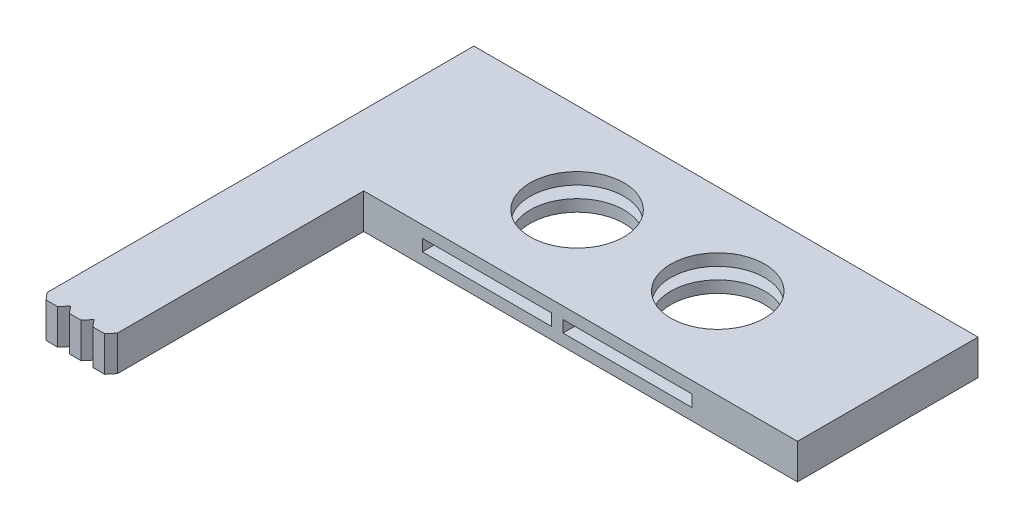
ISO-10303-21;
HEADER;
FILE_DESCRIPTION(('STEP AP214'),'2;1');
FILE_NAME('part.step','',(''),(''),'','','');
FILE_SCHEMA(('AUTOMOTIVE_DESIGN { 1 0 10303 214 1 1 1 1 }'));
ENDSEC;
DATA;
#1=APPLICATION_CONTEXT('core data for automotive mechanical design processes');
#2=APPLICATION_PROTOCOL_DEFINITION('international standard','automotive_design',2000,#1);
#3=PRODUCT_CONTEXT('',#1,'mechanical');
#4=PRODUCT('Part','Part','',(#3));
#5=PRODUCT_RELATED_PRODUCT_CATEGORY('part','',(#4));
#6=PRODUCT_DEFINITION_FORMATION('','',#4);
#7=PRODUCT_DEFINITION_CONTEXT('part definition',#1,'design');
#8=PRODUCT_DEFINITION('design','',#6,#7);
#9=PRODUCT_DEFINITION_SHAPE('','',#8);
#10=(LENGTH_UNIT() NAMED_UNIT(*) SI_UNIT(.MILLI.,.METRE.));
#11=(NAMED_UNIT(*) PLANE_ANGLE_UNIT() SI_UNIT($,.RADIAN.));
#12=(NAMED_UNIT(*) SI_UNIT($,.STERADIAN.) SOLID_ANGLE_UNIT());
#13=UNCERTAINTY_MEASURE_WITH_UNIT(LENGTH_MEASURE(1.E-05),#10,'distance_accuracy_value','');
#14=(GEOMETRIC_REPRESENTATION_CONTEXT(3) GLOBAL_UNCERTAINTY_ASSIGNED_CONTEXT((#13)) GLOBAL_UNIT_ASSIGNED_CONTEXT((#10,
#11,#12)) REPRESENTATION_CONTEXT('',''));
#15=CARTESIAN_POINT('',(0.,0.,0.));
#16=DIRECTION('',(0.,0.,1.));
#17=DIRECTION('',(1.,0.,0.));
#18=AXIS2_PLACEMENT_3D('',#15,#16,#17);
#19=CARTESIAN_POINT('',(16.5,3.,0.));
#20=DIRECTION('',(0.,-1.,0.));
#21=DIRECTION('',(0.,0.,-1.));
#22=AXIS2_PLACEMENT_3D('',#19,#20,#21);
#23=CYLINDRICAL_SURFACE('',#22,4.);
#24=CARTESIAN_POINT('',(16.5,2.,0.));
#25=DIRECTION('',(0.,1.,0.));
#26=DIRECTION('',(-1.,0.,0.));
#27=AXIS2_PLACEMENT_3D('',#24,#25,#26);
#28=CIRCLE('',#27,4.);
#29=CARTESIAN_POINT('',(12.5,2.,0.));
#30=VERTEX_POINT('',#29);
#31=EDGE_CURVE('E39',#30,#30,#28,.T.);
#32=ORIENTED_EDGE('',*,*,#31,.F.);
#33=EDGE_LOOP('',(#32));
#34=FACE_BOUND('',#33,.T.);
#35=CARTESIAN_POINT('',(16.5,3.,0.));
#36=DIRECTION('',(0.,1.,0.));
#37=DIRECTION('',(0.,0.,1.));
#38=AXIS2_PLACEMENT_3D('',#35,#36,#37);
#39=CIRCLE('',#38,4.);
#40=CARTESIAN_POINT('',(16.5,3.,4.));
#41=VERTEX_POINT('',#40);
#42=EDGE_CURVE('E256',#41,#41,#39,.T.);
#43=ORIENTED_EDGE('',*,*,#42,.T.);
#44=EDGE_LOOP('',(#43));
#45=FACE_BOUND('',#44,.T.);
#46=ADVANCED_FACE('F35',(#34,#45),#23,.F.);
#47=CARTESIAN_POINT('',(28.5,3.,0.));
#48=DIRECTION('',(0.,-1.,0.));
#49=DIRECTION('',(0.,0.,-1.));
#50=AXIS2_PLACEMENT_3D('',#47,#48,#49);
#51=CYLINDRICAL_SURFACE('',#50,4.);
#52=CARTESIAN_POINT('',(28.5,2.,0.));
#53=DIRECTION('',(0.,1.,0.));
#54=DIRECTION('',(-1.,0.,0.));
#55=AXIS2_PLACEMENT_3D('',#52,#53,#54);
#56=CIRCLE('',#55,4.);
#57=CARTESIAN_POINT('',(24.5,2.,0.));
#58=VERTEX_POINT('',#57);
#59=EDGE_CURVE('E359',#58,#58,#56,.T.);
#60=ORIENTED_EDGE('',*,*,#59,.F.);
#61=EDGE_LOOP('',(#60));
#62=FACE_BOUND('',#61,.T.);
#63=CARTESIAN_POINT('',(28.5,3.,0.));
#64=DIRECTION('',(0.,1.,0.));
#65=DIRECTION('',(0.,0.,1.));
#66=AXIS2_PLACEMENT_3D('',#63,#64,#65);
#67=CIRCLE('',#66,4.);
#68=CARTESIAN_POINT('',(28.5,3.,4.));
#69=VERTEX_POINT('',#68);
#70=EDGE_CURVE('E249',#69,#69,#67,.T.);
#71=ORIENTED_EDGE('',*,*,#70,.T.);
#72=EDGE_LOOP('',(#71));
#73=FACE_BOUND('',#72,.T.);
#74=ADVANCED_FACE('F373',(#62,#73),#51,.F.);
#75=CARTESIAN_POINT('',(0.,3.,0.));
#76=DIRECTION('',(0.,1.,0.));
#77=DIRECTION('',(0.,0.,1.));
#78=AXIS2_PLACEMENT_3D('',#75,#76,#77);
#79=PLANE('',#78);
#80=ORIENTED_EDGE('',*,*,#42,.F.);
#81=EDGE_LOOP('',(#80));
#82=FACE_BOUND('',#81,.T.);
#83=DIRECTION('',(-1.,0.,0.));
#84=VECTOR('',#83,1.);
#85=CARTESIAN_POINT('',(43.,3.,-7.7));
#86=LINE('',#85,#84);
#87=CARTESIAN_POINT('',(43.,3.,-7.7));
#88=VERTEX_POINT('',#87);
#89=CARTESIAN_POINT('',(0.,3.,-7.69999999999999));
#90=VERTEX_POINT('',#89);
#91=EDGE_CURVE('E262',#88,#90,#86,.T.);
#92=ORIENTED_EDGE('',*,*,#91,.T.);
#93=DIRECTION('',(0.,0.,1.));
#94=VECTOR('',#93,1.);
#95=CARTESIAN_POINT('',(0.,3.,-7.69999999999999));
#96=LINE('',#95,#94);
#97=CARTESIAN_POINT('',(0.,3.,28.7));
#98=VERTEX_POINT('',#97);
#99=EDGE_CURVE('E265',#90,#98,#96,.T.);
#100=ORIENTED_EDGE('',*,*,#99,.T.);
#101=DIRECTION('',(0.640868523132762,0.,0.767650660168825));
#102=VECTOR('',#101,1.);
#103=CARTESIAN_POINT('',(0.,3.,28.7));
#104=LINE('',#103,#102);
#105=CARTESIAN_POINT('',(0.50090638076843,3.,29.3));
#106=VERTEX_POINT('',#105);
#107=EDGE_CURVE('E268',#98,#106,#104,.T.);
#108=ORIENTED_EDGE('',*,*,#107,.T.);
#109=DIRECTION('',(1.,0.,0.));
#110=VECTOR('',#109,1.);
#111=CARTESIAN_POINT('',(0.50090638076843,3.,29.3));
#112=LINE('',#111,#110);
#113=CARTESIAN_POINT('',(1.49909361923161,3.,29.3));
#114=VERTEX_POINT('',#113);
#115=EDGE_CURVE('E270',#106,#114,#112,.T.);
#116=ORIENTED_EDGE('',*,*,#115,.T.);
#117=DIRECTION('',(0.640868523132743,0.,-0.76765066016884));
#118=VECTOR('',#117,1.);
#119=CARTESIAN_POINT('',(2.00000000000001,3.,28.7));
#120=LINE('',#119,#118);
#121=CARTESIAN_POINT('',(2.00000000000001,3.,28.7));
#122=VERTEX_POINT('',#121);
#123=EDGE_CURVE('E272',#114,#122,#120,.T.);
#124=ORIENTED_EDGE('',*,*,#123,.T.);
#125=DIRECTION('',(0.640868523132738,0.,0.767650660168845));
#126=VECTOR('',#125,1.);
#127=CARTESIAN_POINT('',(2.00000000000001,3.,28.7));
#128=LINE('',#127,#126);
#129=CARTESIAN_POINT('',(2.50090638076841,3.,29.3));
#130=VERTEX_POINT('',#129);
#131=EDGE_CURVE('E274',#122,#130,#128,.T.);
#132=ORIENTED_EDGE('',*,*,#131,.T.);
#133=DIRECTION('',(1.,0.,0.));
#134=VECTOR('',#133,1.);
#135=CARTESIAN_POINT('',(2.50090638076841,3.,29.3));
#136=LINE('',#135,#134);
#137=CARTESIAN_POINT('',(3.49909361923159,3.,29.3));
#138=VERTEX_POINT('',#137);
#139=EDGE_CURVE('E276',#130,#138,#136,.T.);
#140=ORIENTED_EDGE('',*,*,#139,.T.);
#141=DIRECTION('',(0.640868523132749,0.,-0.767650660168835));
#142=VECTOR('',#141,1.);
#143=CARTESIAN_POINT('',(4.,3.,28.7));
#144=LINE('',#143,#142);
#145=CARTESIAN_POINT('',(4.,3.,28.7));
#146=VERTEX_POINT('',#145);
#147=EDGE_CURVE('E278',#138,#146,#144,.T.);
#148=ORIENTED_EDGE('',*,*,#147,.T.);
#149=DIRECTION('',(0.640868523132732,0.,0.76765066016885));
#150=VECTOR('',#149,1.);
#151=CARTESIAN_POINT('',(4.,3.,28.7));
#152=LINE('',#151,#150);
#153=CARTESIAN_POINT('',(4.50090638076838,3.,29.3));
#154=VERTEX_POINT('',#153);
#155=EDGE_CURVE('E280',#146,#154,#152,.T.);
#156=ORIENTED_EDGE('',*,*,#155,.T.);
#157=DIRECTION('',(1.,0.,0.));
#158=VECTOR('',#157,1.);
#159=CARTESIAN_POINT('',(4.50090638076838,3.,29.3));
#160=LINE('',#159,#158);
#161=CARTESIAN_POINT('',(5.49909361923156,3.,29.3));
#162=VERTEX_POINT('',#161);
#163=EDGE_CURVE('E282',#154,#162,#160,.T.);
#164=ORIENTED_EDGE('',*,*,#163,.T.);
#165=DIRECTION('',(0.640868523132743,0.,-0.76765066016884));
#166=VECTOR('',#165,1.);
#167=CARTESIAN_POINT('',(5.99999999999997,3.,28.7));
#168=LINE('',#167,#166);
#169=CARTESIAN_POINT('',(5.99999999999997,3.,28.7));
#170=VERTEX_POINT('',#169);
#171=EDGE_CURVE('E284',#162,#170,#168,.T.);
#172=ORIENTED_EDGE('',*,*,#171,.T.);
#173=DIRECTION('',(0.,0.,-1.));
#174=VECTOR('',#173,1.);
#175=CARTESIAN_POINT('',(5.99999999999997,3.,28.7));
#176=LINE('',#175,#174);
#177=CARTESIAN_POINT('',(5.99999999999998,3.,7.7));
#178=VERTEX_POINT('',#177);
#179=EDGE_CURVE('E286',#170,#178,#176,.T.);
#180=ORIENTED_EDGE('',*,*,#179,.T.);
#181=DIRECTION('',(1.,0.,0.));
#182=VECTOR('',#181,1.);
#183=CARTESIAN_POINT('',(5.99999999999998,3.,7.7));
#184=LINE('',#183,#182);
#185=CARTESIAN_POINT('',(43.,3.,7.7));
#186=VERTEX_POINT('',#185);
#187=EDGE_CURVE('E288',#178,#186,#184,.T.);
#188=ORIENTED_EDGE('',*,*,#187,.T.);
#189=DIRECTION('',(0.,0.,-1.));
#190=VECTOR('',#189,1.);
#191=CARTESIAN_POINT('',(43.,3.,-7.7));
#192=LINE('',#191,#190);
#193=EDGE_CURVE('E290',#186,#88,#192,.T.);
#194=ORIENTED_EDGE('',*,*,#193,.T.);
#195=EDGE_LOOP('',(#92,#100,#108,#116,#124,#132,#140,#148,#156,#164,#172,#180,#188,#194));
#196=FACE_BOUND('',#195,.T.);
#197=ORIENTED_EDGE('',*,*,#70,.F.);
#198=EDGE_LOOP('',(#197));
#199=FACE_BOUND('',#198,.T.);
#200=ADVANCED_FACE('F378',(#82,#196,#199),#79,.T.);
#201=CARTESIAN_POINT('',(0.,0.,0.));
#202=DIRECTION('',(0.,1.,0.));
#203=DIRECTION('',(0.,0.,1.));
#204=AXIS2_PLACEMENT_3D('',#201,#202,#203);
#205=PLANE('',#204);
#206=DIRECTION('',(-1.,0.,0.));
#207=VECTOR('',#206,1.);
#208=CARTESIAN_POINT('',(43.,0.,-7.7));
#209=LINE('',#208,#207);
#210=CARTESIAN_POINT('',(43.,0.,-7.7));
#211=VERTEX_POINT('',#210);
#212=CARTESIAN_POINT('',(0.,0.,-7.69999999999999));
#213=VERTEX_POINT('',#212);
#214=EDGE_CURVE('E259',#211,#213,#209,.T.);
#215=ORIENTED_EDGE('',*,*,#214,.F.);
#216=DIRECTION('',(0.,0.,-1.));
#217=VECTOR('',#216,1.);
#218=CARTESIAN_POINT('',(43.,0.,-7.7));
#219=LINE('',#218,#217);
#220=CARTESIAN_POINT('',(43.,0.,7.7));
#221=VERTEX_POINT('',#220);
#222=EDGE_CURVE('E266',#221,#211,#219,.T.);
#223=ORIENTED_EDGE('',*,*,#222,.F.);
#224=DIRECTION('',(1.,0.,0.));
#225=VECTOR('',#224,1.);
#226=CARTESIAN_POINT('',(5.99999999999998,0.,7.7));
#227=LINE('',#226,#225);
#228=CARTESIAN_POINT('',(5.99999999999998,0.,7.7));
#229=VERTEX_POINT('',#228);
#230=EDGE_CURVE('E317',#229,#221,#227,.T.);
#231=ORIENTED_EDGE('',*,*,#230,.F.);
#232=DIRECTION('',(0.,0.,-1.));
#233=VECTOR('',#232,1.);
#234=CARTESIAN_POINT('',(5.99999999999997,0.,28.7));
#235=LINE('',#234,#233);
#236=CARTESIAN_POINT('',(5.99999999999997,0.,28.7));
#237=VERTEX_POINT('',#236);
#238=EDGE_CURVE('E315',#237,#229,#235,.T.);
#239=ORIENTED_EDGE('',*,*,#238,.F.);
#240=DIRECTION('',(0.640868523132743,0.,-0.76765066016884));
#241=VECTOR('',#240,1.);
#242=CARTESIAN_POINT('',(5.99999999999997,0.,28.7));
#243=LINE('',#242,#241);
#244=CARTESIAN_POINT('',(5.49909361923156,0.,29.3));
#245=VERTEX_POINT('',#244);
#246=EDGE_CURVE('E313',#245,#237,#243,.T.);
#247=ORIENTED_EDGE('',*,*,#246,.F.);
#248=DIRECTION('',(1.,0.,0.));
#249=VECTOR('',#248,1.);
#250=CARTESIAN_POINT('',(4.50090638076838,0.,29.3));
#251=LINE('',#250,#249);
#252=CARTESIAN_POINT('',(4.50090638076838,0.,29.3));
#253=VERTEX_POINT('',#252);
#254=EDGE_CURVE('E311',#253,#245,#251,.T.);
#255=ORIENTED_EDGE('',*,*,#254,.F.);
#256=DIRECTION('',(0.640868523132732,0.,0.76765066016885));
#257=VECTOR('',#256,1.);
#258=CARTESIAN_POINT('',(4.,0.,28.7));
#259=LINE('',#258,#257);
#260=CARTESIAN_POINT('',(4.,0.,28.7));
#261=VERTEX_POINT('',#260);
#262=EDGE_CURVE('E309',#261,#253,#259,.T.);
#263=ORIENTED_EDGE('',*,*,#262,.F.);
#264=DIRECTION('',(0.640868523132749,0.,-0.767650660168835));
#265=VECTOR('',#264,1.);
#266=CARTESIAN_POINT('',(4.,0.,28.7));
#267=LINE('',#266,#265);
#268=CARTESIAN_POINT('',(3.49909361923159,0.,29.3));
#269=VERTEX_POINT('',#268);
#270=EDGE_CURVE('E307',#269,#261,#267,.T.);
#271=ORIENTED_EDGE('',*,*,#270,.F.);
#272=DIRECTION('',(1.,0.,0.));
#273=VECTOR('',#272,1.);
#274=CARTESIAN_POINT('',(2.50090638076841,0.,29.3));
#275=LINE('',#274,#273);
#276=CARTESIAN_POINT('',(2.50090638076841,0.,29.3));
#277=VERTEX_POINT('',#276);
#278=EDGE_CURVE('E305',#277,#269,#275,.T.);
#279=ORIENTED_EDGE('',*,*,#278,.F.);
#280=DIRECTION('',(0.640868523132738,0.,0.767650660168845));
#281=VECTOR('',#280,1.);
#282=CARTESIAN_POINT('',(2.00000000000001,0.,28.7));
#283=LINE('',#282,#281);
#284=CARTESIAN_POINT('',(2.00000000000001,0.,28.7));
#285=VERTEX_POINT('',#284);
#286=EDGE_CURVE('E303',#285,#277,#283,.T.);
#287=ORIENTED_EDGE('',*,*,#286,.F.);
#288=DIRECTION('',(0.640868523132743,0.,-0.76765066016884));
#289=VECTOR('',#288,1.);
#290=CARTESIAN_POINT('',(2.00000000000001,0.,28.7));
#291=LINE('',#290,#289);
#292=CARTESIAN_POINT('',(1.49909361923161,0.,29.3));
#293=VERTEX_POINT('',#292);
#294=EDGE_CURVE('E301',#293,#285,#291,.T.);
#295=ORIENTED_EDGE('',*,*,#294,.F.);
#296=DIRECTION('',(1.,0.,0.));
#297=VECTOR('',#296,1.);
#298=CARTESIAN_POINT('',(0.50090638076843,0.,29.3));
#299=LINE('',#298,#297);
#300=CARTESIAN_POINT('',(0.50090638076843,0.,29.3));
#301=VERTEX_POINT('',#300);
#302=EDGE_CURVE('E299',#301,#293,#299,.T.);
#303=ORIENTED_EDGE('',*,*,#302,.F.);
#304=DIRECTION('',(0.640868523132762,0.,0.767650660168825));
#305=VECTOR('',#304,1.);
#306=CARTESIAN_POINT('',(0.,0.,28.7));
#307=LINE('',#306,#305);
#308=CARTESIAN_POINT('',(0.,0.,28.7));
#309=VERTEX_POINT('',#308);
#310=EDGE_CURVE('E297',#309,#301,#307,.T.);
#311=ORIENTED_EDGE('',*,*,#310,.F.);
#312=DIRECTION('',(0.,0.,1.));
#313=VECTOR('',#312,1.);
#314=CARTESIAN_POINT('',(0.,0.,-7.69999999999999));
#315=LINE('',#314,#313);
#316=EDGE_CURVE('E295',#213,#309,#315,.T.);
#317=ORIENTED_EDGE('',*,*,#316,.F.);
#318=EDGE_LOOP('',(#215,#223,#231,#239,#247,#255,#263,#271,#279,#287,#295,#303,#311,#317));
#319=FACE_BOUND('',#318,.T.);
#320=CARTESIAN_POINT('',(16.5,0.,0.));
#321=DIRECTION('',(0.,1.,0.));
#322=DIRECTION('',(0.,0.,1.));
#323=AXIS2_PLACEMENT_3D('',#320,#321,#322);
#324=CIRCLE('',#323,4.);
#325=CARTESIAN_POINT('',(16.5,0.,4.));
#326=VERTEX_POINT('',#325);
#327=EDGE_CURVE('E252',#326,#326,#324,.T.);
#328=ORIENTED_EDGE('',*,*,#327,.T.);
#329=EDGE_LOOP('',(#328));
#330=FACE_BOUND('',#329,.T.);
#331=CARTESIAN_POINT('',(28.5,0.,0.));
#332=DIRECTION('',(0.,1.,0.));
#333=DIRECTION('',(0.,0.,1.));
#334=AXIS2_PLACEMENT_3D('',#331,#332,#333);
#335=CIRCLE('',#334,4.);
#336=CARTESIAN_POINT('',(28.5,0.,4.));
#337=VERTEX_POINT('',#336);
#338=EDGE_CURVE('E253',#337,#337,#335,.T.);
#339=ORIENTED_EDGE('',*,*,#338,.T.);
#340=EDGE_LOOP('',(#339));
#341=FACE_BOUND('',#340,.T.);
#342=ADVANCED_FACE('F381',(#319,#330,#341),#205,.F.);
#343=CARTESIAN_POINT('',(43.,3.,-7.7));
#344=DIRECTION('',(0.,0.,1.));
#345=DIRECTION('',(1.,0.,0.));
#346=AXIS2_PLACEMENT_3D('',#343,#344,#345);
#347=PLANE('',#346);
#348=ORIENTED_EDGE('',*,*,#214,.T.);
#349=DIRECTION('',(0.,-1.,0.));
#350=VECTOR('',#349,1.);
#351=CARTESIAN_POINT('',(0.,3.,-7.69999999999999));
#352=LINE('',#351,#350);
#353=EDGE_CURVE('E12',#90,#213,#352,.T.);
#354=ORIENTED_EDGE('',*,*,#353,.F.);
#355=ORIENTED_EDGE('',*,*,#91,.F.);
#356=DIRECTION('',(0.,-1.,0.));
#357=VECTOR('',#356,1.);
#358=CARTESIAN_POINT('',(43.,3.,-7.7));
#359=LINE('',#358,#357);
#360=EDGE_CURVE('E292',#88,#211,#359,.T.);
#361=ORIENTED_EDGE('',*,*,#360,.T.);
#362=EDGE_LOOP('',(#348,#354,#355,#361));
#363=FACE_BOUND('',#362,.T.);
#364=ADVANCED_FACE('F37',(#363),#347,.F.);
#365=CARTESIAN_POINT('',(0.,3.,-7.69999999999999));
#366=DIRECTION('',(1.,0.,0.));
#367=DIRECTION('',(0.,0.,-1.));
#368=AXIS2_PLACEMENT_3D('',#365,#366,#367);
#369=PLANE('',#368);
#370=ORIENTED_EDGE('',*,*,#316,.T.);
#371=DIRECTION('',(0.,-1.,0.));
#372=VECTOR('',#371,1.);
#373=CARTESIAN_POINT('',(0.,3.,28.7));
#374=LINE('',#373,#372);
#375=EDGE_CURVE('E44',#98,#309,#374,.T.);
#376=ORIENTED_EDGE('',*,*,#375,.F.);
#377=ORIENTED_EDGE('',*,*,#99,.F.);
#378=ORIENTED_EDGE('',*,*,#353,.T.);
#379=EDGE_LOOP('',(#370,#376,#377,#378));
#380=FACE_BOUND('',#379,.T.);
#381=ADVANCED_FACE('F416',(#380),#369,.F.);
#382=CARTESIAN_POINT('',(0.,3.,28.7));
#383=DIRECTION('',(0.767650660168825,0.,-0.640868523132762));
#384=DIRECTION('',(-0.640868523132762,0.,-0.767650660168825));
#385=AXIS2_PLACEMENT_3D('',#382,#383,#384);
#386=PLANE('',#385);
#387=ORIENTED_EDGE('',*,*,#310,.T.);
#388=DIRECTION('',(0.,-1.,0.));
#389=VECTOR('',#388,1.);
#390=CARTESIAN_POINT('',(0.50090638076843,3.,29.3));
#391=LINE('',#390,#389);
#392=EDGE_CURVE('E352',#106,#301,#391,.T.);
#393=ORIENTED_EDGE('',*,*,#392,.F.);
#394=ORIENTED_EDGE('',*,*,#107,.F.);
#395=ORIENTED_EDGE('',*,*,#375,.T.);
#396=EDGE_LOOP('',(#387,#393,#394,#395));
#397=FACE_BOUND('',#396,.T.);
#398=ADVANCED_FACE('F461',(#397),#386,.F.);
#399=CARTESIAN_POINT('',(0.50090638076843,3.,29.3));
#400=DIRECTION('',(0.,0.,-1.));
#401=DIRECTION('',(-1.,0.,0.));
#402=AXIS2_PLACEMENT_3D('',#399,#400,#401);
#403=PLANE('',#402);
#404=ORIENTED_EDGE('',*,*,#302,.T.);
#405=DIRECTION('',(0.,-1.,0.));
#406=VECTOR('',#405,1.);
#407=CARTESIAN_POINT('',(1.49909361923161,3.,29.3));
#408=LINE('',#407,#406);
#409=EDGE_CURVE('E349',#114,#293,#408,.T.);
#410=ORIENTED_EDGE('',*,*,#409,.F.);
#411=ORIENTED_EDGE('',*,*,#115,.F.);
#412=ORIENTED_EDGE('',*,*,#392,.T.);
#413=EDGE_LOOP('',(#404,#410,#411,#412));
#414=FACE_BOUND('',#413,.T.);
#415=ADVANCED_FACE('F457',(#414),#403,.F.);
#416=CARTESIAN_POINT('',(2.00000000000001,3.,28.7));
#417=DIRECTION('',(-0.76765066016884,0.,-0.640868523132743));
#418=DIRECTION('',(-0.640868523132743,0.,0.76765066016884));
#419=AXIS2_PLACEMENT_3D('',#416,#417,#418);
#420=PLANE('',#419);
#421=ORIENTED_EDGE('',*,*,#294,.T.);
#422=DIRECTION('',(0.,-1.,0.));
#423=VECTOR('',#422,1.);
#424=CARTESIAN_POINT('',(2.00000000000001,3.,28.7));
#425=LINE('',#424,#423);
#426=EDGE_CURVE('E346',#122,#285,#425,.T.);
#427=ORIENTED_EDGE('',*,*,#426,.F.);
#428=ORIENTED_EDGE('',*,*,#123,.F.);
#429=ORIENTED_EDGE('',*,*,#409,.T.);
#430=EDGE_LOOP('',(#421,#427,#428,#429));
#431=FACE_BOUND('',#430,.T.);
#432=ADVANCED_FACE('F453',(#431),#420,.F.);
#433=CARTESIAN_POINT('',(2.00000000000001,3.,28.7));
#434=DIRECTION('',(0.767650660168845,0.,-0.640868523132738));
#435=DIRECTION('',(-0.640868523132738,0.,-0.767650660168845));
#436=AXIS2_PLACEMENT_3D('',#433,#434,#435);
#437=PLANE('',#436);
#438=ORIENTED_EDGE('',*,*,#286,.T.);
#439=DIRECTION('',(0.,-1.,0.));
#440=VECTOR('',#439,1.);
#441=CARTESIAN_POINT('',(2.50090638076841,3.,29.3));
#442=LINE('',#441,#440);
#443=EDGE_CURVE('E343',#130,#277,#442,.T.);
#444=ORIENTED_EDGE('',*,*,#443,.F.);
#445=ORIENTED_EDGE('',*,*,#131,.F.);
#446=ORIENTED_EDGE('',*,*,#426,.T.);
#447=EDGE_LOOP('',(#438,#444,#445,#446));
#448=FACE_BOUND('',#447,.T.);
#449=ADVANCED_FACE('F449',(#448),#437,.F.);
#450=CARTESIAN_POINT('',(2.50090638076841,3.,29.3));
#451=DIRECTION('',(0.,0.,-1.));
#452=DIRECTION('',(-1.,0.,0.));
#453=AXIS2_PLACEMENT_3D('',#450,#451,#452);
#454=PLANE('',#453);
#455=ORIENTED_EDGE('',*,*,#278,.T.);
#456=DIRECTION('',(0.,-1.,0.));
#457=VECTOR('',#456,1.);
#458=CARTESIAN_POINT('',(3.49909361923159,3.,29.3));
#459=LINE('',#458,#457);
#460=EDGE_CURVE('E340',#138,#269,#459,.T.);
#461=ORIENTED_EDGE('',*,*,#460,.F.);
#462=ORIENTED_EDGE('',*,*,#139,.F.);
#463=ORIENTED_EDGE('',*,*,#443,.T.);
#464=EDGE_LOOP('',(#455,#461,#462,#463));
#465=FACE_BOUND('',#464,.T.);
#466=ADVANCED_FACE('F445',(#465),#454,.F.);
#467=CARTESIAN_POINT('',(4.,3.,28.7));
#468=DIRECTION('',(-0.767650660168835,0.,-0.640868523132749));
#469=DIRECTION('',(-0.640868523132749,0.,0.767650660168836));
#470=AXIS2_PLACEMENT_3D('',#467,#468,#469);
#471=PLANE('',#470);
#472=ORIENTED_EDGE('',*,*,#270,.T.);
#473=DIRECTION('',(0.,-1.,0.));
#474=VECTOR('',#473,1.);
#475=CARTESIAN_POINT('',(4.,3.,28.7));
#476=LINE('',#475,#474);
#477=EDGE_CURVE('E337',#146,#261,#476,.T.);
#478=ORIENTED_EDGE('',*,*,#477,.F.);
#479=ORIENTED_EDGE('',*,*,#147,.F.);
#480=ORIENTED_EDGE('',*,*,#460,.T.);
#481=EDGE_LOOP('',(#472,#478,#479,#480));
#482=FACE_BOUND('',#481,.T.);
#483=ADVANCED_FACE('F441',(#482),#471,.F.);
#484=CARTESIAN_POINT('',(4.,3.,28.7));
#485=DIRECTION('',(0.767650660168849,0.,-0.640868523132732));
#486=DIRECTION('',(-0.640868523132732,0.,-0.76765066016885));
#487=AXIS2_PLACEMENT_3D('',#484,#485,#486);
#488=PLANE('',#487);
#489=ORIENTED_EDGE('',*,*,#262,.T.);
#490=DIRECTION('',(0.,-1.,0.));
#491=VECTOR('',#490,1.);
#492=CARTESIAN_POINT('',(4.50090638076838,3.,29.3));
#493=LINE('',#492,#491);
#494=EDGE_CURVE('E334',#154,#253,#493,.T.);
#495=ORIENTED_EDGE('',*,*,#494,.F.);
#496=ORIENTED_EDGE('',*,*,#155,.F.);
#497=ORIENTED_EDGE('',*,*,#477,.T.);
#498=EDGE_LOOP('',(#489,#495,#496,#497));
#499=FACE_BOUND('',#498,.T.);
#500=ADVANCED_FACE('F437',(#499),#488,.F.);
#501=CARTESIAN_POINT('',(4.50090638076838,3.,29.3));
#502=DIRECTION('',(0.,0.,-1.));
#503=DIRECTION('',(-1.,0.,0.));
#504=AXIS2_PLACEMENT_3D('',#501,#502,#503);
#505=PLANE('',#504);
#506=ORIENTED_EDGE('',*,*,#254,.T.);
#507=DIRECTION('',(0.,-1.,0.));
#508=VECTOR('',#507,1.);
#509=CARTESIAN_POINT('',(5.49909361923156,3.,29.3));
#510=LINE('',#509,#508);
#511=EDGE_CURVE('E331',#162,#245,#510,.T.);
#512=ORIENTED_EDGE('',*,*,#511,.F.);
#513=ORIENTED_EDGE('',*,*,#163,.F.);
#514=ORIENTED_EDGE('',*,*,#494,.T.);
#515=EDGE_LOOP('',(#506,#512,#513,#514));
#516=FACE_BOUND('',#515,.T.);
#517=ADVANCED_FACE('F433',(#516),#505,.F.);
#518=CARTESIAN_POINT('',(5.99999999999997,3.,28.7));
#519=DIRECTION('',(-0.76765066016884,0.,-0.640868523132743));
#520=DIRECTION('',(-0.640868523132743,0.,0.76765066016884));
#521=AXIS2_PLACEMENT_3D('',#518,#519,#520);
#522=PLANE('',#521);
#523=ORIENTED_EDGE('',*,*,#246,.T.);
#524=DIRECTION('',(0.,-1.,0.));
#525=VECTOR('',#524,1.);
#526=CARTESIAN_POINT('',(5.99999999999997,3.,28.7));
#527=LINE('',#526,#525);
#528=EDGE_CURVE('E328',#170,#237,#527,.T.);
#529=ORIENTED_EDGE('',*,*,#528,.F.);
#530=ORIENTED_EDGE('',*,*,#171,.F.);
#531=ORIENTED_EDGE('',*,*,#511,.T.);
#532=EDGE_LOOP('',(#523,#529,#530,#531));
#533=FACE_BOUND('',#532,.T.);
#534=ADVANCED_FACE('F429',(#533),#522,.F.);
#535=CARTESIAN_POINT('',(5.99999999999997,3.,28.7));
#536=DIRECTION('',(-1.,0.,0.));
#537=DIRECTION('',(0.,0.,1.));
#538=AXIS2_PLACEMENT_3D('',#535,#536,#537);
#539=PLANE('',#538);
#540=ORIENTED_EDGE('',*,*,#238,.T.);
#541=DIRECTION('',(0.,-1.,0.));
#542=VECTOR('',#541,1.);
#543=CARTESIAN_POINT('',(5.99999999999998,3.,7.7));
#544=LINE('',#543,#542);
#545=EDGE_CURVE('E325',#178,#229,#544,.T.);
#546=ORIENTED_EDGE('',*,*,#545,.F.);
#547=ORIENTED_EDGE('',*,*,#179,.F.);
#548=ORIENTED_EDGE('',*,*,#528,.T.);
#549=EDGE_LOOP('',(#540,#546,#547,#548));
#550=FACE_BOUND('',#549,.T.);
#551=ADVANCED_FACE('F426',(#550),#539,.F.);
#552=CARTESIAN_POINT('',(5.99999999999998,3.,7.7));
#553=DIRECTION('',(0.,0.,-1.));
#554=DIRECTION('',(-1.,0.,0.));
#555=AXIS2_PLACEMENT_3D('',#552,#553,#554);
#556=PLANE('',#555);
#557=DIRECTION('',(1.,0.,0.));
#558=VECTOR('',#557,1.);
#559=CARTESIAN_POINT('',(11.,1.,7.7));
#560=LINE('',#559,#558);
#561=CARTESIAN_POINT('',(11.,1.,7.7));
#562=VERTEX_POINT('',#561);
#563=CARTESIAN_POINT('',(22.,1.,7.7));
#564=VERTEX_POINT('',#563);
#565=EDGE_CURVE('E203',#562,#564,#560,.T.);
#566=ORIENTED_EDGE('',*,*,#565,.F.);
#567=DIRECTION('',(0.,-1.,0.));
#568=VECTOR('',#567,1.);
#569=CARTESIAN_POINT('',(11.,2.,7.7));
#570=LINE('',#569,#568);
#571=CARTESIAN_POINT('',(11.,2.,7.7));
#572=VERTEX_POINT('',#571);
#573=EDGE_CURVE('E52',#572,#562,#570,.T.);
#574=ORIENTED_EDGE('',*,*,#573,.F.);
#575=DIRECTION('',(-1.,0.,0.));
#576=VECTOR('',#575,1.);
#577=CARTESIAN_POINT('',(11.,2.,7.7));
#578=LINE('',#577,#576);
#579=CARTESIAN_POINT('',(22.,2.,7.7));
#580=VERTEX_POINT('',#579);
#581=EDGE_CURVE('E210',#580,#572,#578,.T.);
#582=ORIENTED_EDGE('',*,*,#581,.F.);
#583=DIRECTION('',(0.,1.,0.));
#584=VECTOR('',#583,1.);
#585=CARTESIAN_POINT('',(22.,2.,7.7));
#586=LINE('',#585,#584);
#587=EDGE_CURVE('E193',#564,#580,#586,.T.);
#588=ORIENTED_EDGE('',*,*,#587,.F.);
#589=EDGE_LOOP('',(#566,#574,#582,#588));
#590=FACE_BOUND('',#589,.T.);
#591=DIRECTION('',(1.,0.,0.));
#592=VECTOR('',#591,1.);
#593=CARTESIAN_POINT('',(23.,1.,7.7));
#594=LINE('',#593,#592);
#595=CARTESIAN_POINT('',(23.,1.,7.7));
#596=VERTEX_POINT('',#595);
#597=CARTESIAN_POINT('',(34.,1.,7.7));
#598=VERTEX_POINT('',#597);
#599=EDGE_CURVE('E232',#596,#598,#594,.T.);
#600=ORIENTED_EDGE('',*,*,#599,.F.);
#601=DIRECTION('',(0.,-1.,0.));
#602=VECTOR('',#601,1.);
#603=CARTESIAN_POINT('',(23.,2.,7.7));
#604=LINE('',#603,#602);
#605=CARTESIAN_POINT('',(23.,2.,7.7));
#606=VERTEX_POINT('',#605);
#607=EDGE_CURVE('E60',#606,#596,#604,.T.);
#608=ORIENTED_EDGE('',*,*,#607,.F.);
#609=DIRECTION('',(-1.,0.,0.));
#610=VECTOR('',#609,1.);
#611=CARTESIAN_POINT('',(23.,2.,7.7));
#612=LINE('',#611,#610);
#613=CARTESIAN_POINT('',(34.,2.,7.7));
#614=VERTEX_POINT('',#613);
#615=EDGE_CURVE('E238',#614,#606,#612,.T.);
#616=ORIENTED_EDGE('',*,*,#615,.F.);
#617=DIRECTION('',(0.,1.,0.));
#618=VECTOR('',#617,1.);
#619=CARTESIAN_POINT('',(34.,2.,7.7));
#620=LINE('',#619,#618);
#621=EDGE_CURVE('E235',#598,#614,#620,.T.);
#622=ORIENTED_EDGE('',*,*,#621,.F.);
#623=EDGE_LOOP('',(#600,#608,#616,#622));
#624=FACE_BOUND('',#623,.T.);
#625=ORIENTED_EDGE('',*,*,#230,.T.);
#626=DIRECTION('',(0.,-1.,0.));
#627=VECTOR('',#626,1.);
#628=CARTESIAN_POINT('',(43.,3.,7.7));
#629=LINE('',#628,#627);
#630=EDGE_CURVE('E322',#186,#221,#629,.T.);
#631=ORIENTED_EDGE('',*,*,#630,.F.);
#632=ORIENTED_EDGE('',*,*,#187,.F.);
#633=ORIENTED_EDGE('',*,*,#545,.T.);
#634=EDGE_LOOP('',(#625,#631,#632,#633));
#635=FACE_BOUND('',#634,.T.);
#636=ADVANCED_FACE('F207',(#590,#624,#635),#556,.F.);
#637=CARTESIAN_POINT('',(43.,3.,-7.7));
#638=DIRECTION('',(-1.,0.,0.));
#639=DIRECTION('',(0.,0.,1.));
#640=AXIS2_PLACEMENT_3D('',#637,#638,#639);
#641=PLANE('',#640);
#642=ORIENTED_EDGE('',*,*,#222,.T.);
#643=ORIENTED_EDGE('',*,*,#360,.F.);
#644=ORIENTED_EDGE('',*,*,#193,.F.);
#645=ORIENTED_EDGE('',*,*,#630,.T.);
#646=EDGE_LOOP('',(#642,#643,#644,#645));
#647=FACE_BOUND('',#646,.T.);
#648=ADVANCED_FACE('F404',(#647),#641,.F.);
#649=CARTESIAN_POINT('',(16.5,1.,0.));
#650=DIRECTION('',(0.,-1.,0.));
#651=DIRECTION('',(1.,0.,0.));
#652=AXIS2_PLACEMENT_3D('',#649,#650,#651);
#653=CIRCLE('',#652,4.);
#654=CARTESIAN_POINT('',(20.5,1.,0.));
#655=VERTEX_POINT('',#654);
#656=EDGE_CURVE('E361',#655,#655,#653,.T.);
#657=ORIENTED_EDGE('',*,*,#656,.F.);
#658=EDGE_LOOP('',(#657));
#659=FACE_BOUND('',#658,.T.);
#660=ORIENTED_EDGE('',*,*,#327,.F.);
#661=EDGE_LOOP('',(#660));
#662=FACE_BOUND('',#661,.T.);
#663=ADVANCED_FACE('F375',(#659,#662),#23,.F.);
#664=CARTESIAN_POINT('',(28.5,1.,0.));
#665=DIRECTION('',(0.,-1.,0.));
#666=DIRECTION('',(1.,0.,0.));
#667=AXIS2_PLACEMENT_3D('',#664,#665,#666);
#668=CIRCLE('',#667,4.);
#669=CARTESIAN_POINT('',(32.5,1.,0.));
#670=VERTEX_POINT('',#669);
#671=EDGE_CURVE('E221',#670,#670,#668,.T.);
#672=ORIENTED_EDGE('',*,*,#671,.F.);
#673=EDGE_LOOP('',(#672));
#674=FACE_BOUND('',#673,.T.);
#675=ORIENTED_EDGE('',*,*,#338,.F.);
#676=EDGE_LOOP('',(#675));
#677=FACE_BOUND('',#676,.T.);
#678=ADVANCED_FACE('F391',(#674,#677),#51,.F.);
#679=CARTESIAN_POINT('',(23.,2.,-18.7453610171872));
#680=DIRECTION('',(-1.,0.,0.));
#681=DIRECTION('',(0.,0.,1.));
#682=AXIS2_PLACEMENT_3D('',#679,#680,#681);
#683=PLANE('',#682);
#684=DIRECTION('',(0.,1.,0.));
#685=VECTOR('',#684,1.);
#686=CARTESIAN_POINT('',(23.,2.,-5.7));
#687=LINE('',#686,#685);
#688=CARTESIAN_POINT('',(23.,1.,-5.7));
#689=VERTEX_POINT('',#688);
#690=CARTESIAN_POINT('',(23.,2.,-5.7));
#691=VERTEX_POINT('',#690);
#692=EDGE_CURVE('E228',#689,#691,#687,.T.);
#693=ORIENTED_EDGE('',*,*,#692,.T.);
#694=DIRECTION('',(0.,0.,1.));
#695=VECTOR('',#694,1.);
#696=CARTESIAN_POINT('',(23.,2.,-18.7453610171872));
#697=LINE('',#696,#695);
#698=EDGE_CURVE('E226',#691,#606,#697,.T.);
#699=ORIENTED_EDGE('',*,*,#698,.T.);
#700=ORIENTED_EDGE('',*,*,#607,.T.);
#701=DIRECTION('',(0.,0.,1.));
#702=VECTOR('',#701,1.);
#703=CARTESIAN_POINT('',(23.,1.,-18.7453610171872));
#704=LINE('',#703,#702);
#705=EDGE_CURVE('E241',#689,#596,#704,.T.);
#706=ORIENTED_EDGE('',*,*,#705,.F.);
#707=EDGE_LOOP('',(#693,#699,#700,#706));
#708=FACE_BOUND('',#707,.T.);
#709=ADVANCED_FACE('F397',(#708),#683,.F.);
#710=CARTESIAN_POINT('',(23.,2.,-18.7453610171872));
#711=DIRECTION('',(0.,1.,0.));
#712=DIRECTION('',(-1.,0.,0.));
#713=AXIS2_PLACEMENT_3D('',#710,#711,#712);
#714=PLANE('',#713);
#715=ORIENTED_EDGE('',*,*,#59,.T.);
#716=EDGE_LOOP('',(#715));
#717=FACE_BOUND('',#716,.T.);
#718=DIRECTION('',(1.,0.,0.));
#719=VECTOR('',#718,1.);
#720=CARTESIAN_POINT('',(23.,2.,-5.7));
#721=LINE('',#720,#719);
#722=CARTESIAN_POINT('',(34.,2.,-5.7));
#723=VERTEX_POINT('',#722);
#724=EDGE_CURVE('E225',#691,#723,#721,.T.);
#725=ORIENTED_EDGE('',*,*,#724,.T.);
#726=DIRECTION('',(0.,0.,1.));
#727=VECTOR('',#726,1.);
#728=CARTESIAN_POINT('',(34.,2.,-18.7453610171872));
#729=LINE('',#728,#727);
#730=EDGE_CURVE('E243',#723,#614,#729,.T.);
#731=ORIENTED_EDGE('',*,*,#730,.T.);
#732=ORIENTED_EDGE('',*,*,#615,.T.);
#733=ORIENTED_EDGE('',*,*,#698,.F.);
#734=EDGE_LOOP('',(#725,#731,#732,#733));
#735=FACE_BOUND('',#734,.T.);
#736=ADVANCED_FACE('F403',(#717,#735),#714,.F.);
#737=CARTESIAN_POINT('',(34.,2.,-18.7453610171872));
#738=DIRECTION('',(1.,0.,0.));
#739=DIRECTION('',(0.,0.,-1.));
#740=AXIS2_PLACEMENT_3D('',#737,#738,#739);
#741=PLANE('',#740);
#742=DIRECTION('',(0.,-1.,0.));
#743=VECTOR('',#742,1.);
#744=CARTESIAN_POINT('',(34.,2.,-5.7));
#745=LINE('',#744,#743);
#746=CARTESIAN_POINT('',(34.,1.,-5.7));
#747=VERTEX_POINT('',#746);
#748=EDGE_CURVE('E223',#723,#747,#745,.T.);
#749=ORIENTED_EDGE('',*,*,#748,.T.);
#750=DIRECTION('',(0.,0.,1.));
#751=VECTOR('',#750,1.);
#752=CARTESIAN_POINT('',(34.,1.,-18.7453610171872));
#753=LINE('',#752,#751);
#754=EDGE_CURVE('E245',#747,#598,#753,.T.);
#755=ORIENTED_EDGE('',*,*,#754,.T.);
#756=ORIENTED_EDGE('',*,*,#621,.T.);
#757=ORIENTED_EDGE('',*,*,#730,.F.);
#758=EDGE_LOOP('',(#749,#755,#756,#757));
#759=FACE_BOUND('',#758,.T.);
#760=ADVANCED_FACE('F583',(#759),#741,.F.);
#761=CARTESIAN_POINT('',(23.,1.,-18.7453610171872));
#762=DIRECTION('',(0.,-1.,0.));
#763=DIRECTION('',(1.,0.,0.));
#764=AXIS2_PLACEMENT_3D('',#761,#762,#763);
#765=PLANE('',#764);
#766=ORIENTED_EDGE('',*,*,#671,.T.);
#767=EDGE_LOOP('',(#766));
#768=FACE_BOUND('',#767,.T.);
#769=DIRECTION('',(-1.,0.,0.));
#770=VECTOR('',#769,1.);
#771=CARTESIAN_POINT('',(23.,1.,-5.7));
#772=LINE('',#771,#770);
#773=EDGE_CURVE('E230',#747,#689,#772,.T.);
#774=ORIENTED_EDGE('',*,*,#773,.T.);
#775=ORIENTED_EDGE('',*,*,#705,.T.);
#776=ORIENTED_EDGE('',*,*,#599,.T.);
#777=ORIENTED_EDGE('',*,*,#754,.F.);
#778=EDGE_LOOP('',(#774,#775,#776,#777));
#779=FACE_BOUND('',#778,.T.);
#780=ADVANCED_FACE('F593',(#768,#779),#765,.F.);
#781=CARTESIAN_POINT('',(43.,3.,-5.7));
#782=DIRECTION('',(0.,0.,1.));
#783=DIRECTION('',(1.,0.,0.));
#784=AXIS2_PLACEMENT_3D('',#781,#782,#783);
#785=PLANE('',#784);
#786=ORIENTED_EDGE('',*,*,#692,.F.);
#787=ORIENTED_EDGE('',*,*,#773,.F.);
#788=ORIENTED_EDGE('',*,*,#748,.F.);
#789=ORIENTED_EDGE('',*,*,#724,.F.);
#790=EDGE_LOOP('',(#786,#787,#788,#789));
#791=FACE_BOUND('',#790,.T.);
#792=ADVANCED_FACE('F603',(#791),#785,.T.);
#793=CARTESIAN_POINT('',(11.,2.,-18.7453610171872));
#794=DIRECTION('',(-1.,0.,0.));
#795=DIRECTION('',(0.,0.,1.));
#796=AXIS2_PLACEMENT_3D('',#793,#794,#795);
#797=PLANE('',#796);
#798=DIRECTION('',(0.,1.,0.));
#799=VECTOR('',#798,1.);
#800=CARTESIAN_POINT('',(11.,2.,-5.69999999999999));
#801=LINE('',#800,#799);
#802=CARTESIAN_POINT('',(11.,1.,-5.69999999999999));
#803=VERTEX_POINT('',#802);
#804=CARTESIAN_POINT('',(11.,2.,-5.69999999999999));
#805=VERTEX_POINT('',#804);
#806=EDGE_CURVE('E222',#803,#805,#801,.T.);
#807=ORIENTED_EDGE('',*,*,#806,.T.);
#808=DIRECTION('',(0.,0.,1.));
#809=VECTOR('',#808,1.);
#810=CARTESIAN_POINT('',(11.,2.,-18.7453610171872));
#811=LINE('',#810,#809);
#812=EDGE_CURVE('E215',#805,#572,#811,.T.);
#813=ORIENTED_EDGE('',*,*,#812,.T.);
#814=ORIENTED_EDGE('',*,*,#573,.T.);
#815=DIRECTION('',(0.,0.,1.));
#816=VECTOR('',#815,1.);
#817=CARTESIAN_POINT('',(11.,1.,-18.7453610171872));
#818=LINE('',#817,#816);
#819=EDGE_CURVE('E200',#803,#562,#818,.T.);
#820=ORIENTED_EDGE('',*,*,#819,.F.);
#821=EDGE_LOOP('',(#807,#813,#814,#820));
#822=FACE_BOUND('',#821,.T.);
#823=ADVANCED_FACE('F613',(#822),#797,.F.);
#824=CARTESIAN_POINT('',(11.,2.,-18.7453610171872));
#825=DIRECTION('',(0.,1.,0.));
#826=DIRECTION('',(-1.,0.,0.));
#827=AXIS2_PLACEMENT_3D('',#824,#825,#826);
#828=PLANE('',#827);
#829=ORIENTED_EDGE('',*,*,#31,.T.);
#830=EDGE_LOOP('',(#829));
#831=FACE_BOUND('',#830,.T.);
#832=DIRECTION('',(1.,0.,0.));
#833=VECTOR('',#832,1.);
#834=CARTESIAN_POINT('',(11.,2.,-5.69999999999999));
#835=LINE('',#834,#833);
#836=CARTESIAN_POINT('',(22.,2.,-5.7));
#837=VERTEX_POINT('',#836);
#838=EDGE_CURVE('E662',#805,#837,#835,.T.);
#839=ORIENTED_EDGE('',*,*,#838,.T.);
#840=DIRECTION('',(0.,0.,1.));
#841=VECTOR('',#840,1.);
#842=CARTESIAN_POINT('',(22.,2.,-18.7453610171872));
#843=LINE('',#842,#841);
#844=EDGE_CURVE('E199',#837,#580,#843,.T.);
#845=ORIENTED_EDGE('',*,*,#844,.T.);
#846=ORIENTED_EDGE('',*,*,#581,.T.);
#847=ORIENTED_EDGE('',*,*,#812,.F.);
#848=EDGE_LOOP('',(#839,#845,#846,#847));
#849=FACE_BOUND('',#848,.T.);
#850=ADVANCED_FACE('F368',(#831,#849),#828,.F.);
#851=CARTESIAN_POINT('',(22.,2.,-18.7453610171872));
#852=DIRECTION('',(1.,0.,0.));
#853=DIRECTION('',(0.,0.,-1.));
#854=AXIS2_PLACEMENT_3D('',#851,#852,#853);
#855=PLANE('',#854);
#856=DIRECTION('',(0.,-1.,0.));
#857=VECTOR('',#856,1.);
#858=CARTESIAN_POINT('',(22.,2.,-5.7));
#859=LINE('',#858,#857);
#860=CARTESIAN_POINT('',(22.,1.,-5.7));
#861=VERTEX_POINT('',#860);
#862=EDGE_CURVE('E196',#837,#861,#859,.T.);
#863=ORIENTED_EDGE('',*,*,#862,.T.);
#864=DIRECTION('',(0.,0.,1.));
#865=VECTOR('',#864,1.);
#866=CARTESIAN_POINT('',(22.,1.,-18.7453610171872));
#867=LINE('',#866,#865);
#868=EDGE_CURVE('E188',#861,#564,#867,.T.);
#869=ORIENTED_EDGE('',*,*,#868,.T.);
#870=ORIENTED_EDGE('',*,*,#587,.T.);
#871=ORIENTED_EDGE('',*,*,#844,.F.);
#872=EDGE_LOOP('',(#863,#869,#870,#871));
#873=FACE_BOUND('',#872,.T.);
#874=ADVANCED_FACE('F190',(#873),#855,.F.);
#875=CARTESIAN_POINT('',(11.,1.,-18.7453610171872));
#876=DIRECTION('',(0.,-1.,0.));
#877=DIRECTION('',(1.,0.,0.));
#878=AXIS2_PLACEMENT_3D('',#875,#876,#877);
#879=PLANE('',#878);
#880=ORIENTED_EDGE('',*,*,#656,.T.);
#881=EDGE_LOOP('',(#880));
#882=FACE_BOUND('',#881,.T.);
#883=DIRECTION('',(-1.,0.,0.));
#884=VECTOR('',#883,1.);
#885=CARTESIAN_POINT('',(11.,1.,-5.69999999999999));
#886=LINE('',#885,#884);
#887=EDGE_CURVE('E219',#861,#803,#886,.T.);
#888=ORIENTED_EDGE('',*,*,#887,.T.);
#889=ORIENTED_EDGE('',*,*,#819,.T.);
#890=ORIENTED_EDGE('',*,*,#565,.T.);
#891=ORIENTED_EDGE('',*,*,#868,.F.);
#892=EDGE_LOOP('',(#888,#889,#890,#891));
#893=FACE_BOUND('',#892,.T.);
#894=ADVANCED_FACE('F204',(#882,#893),#879,.F.);
#895=CARTESIAN_POINT('',(43.,3.,-5.7));
#896=DIRECTION('',(0.,0.,1.));
#897=DIRECTION('',(1.,0.,0.));
#898=AXIS2_PLACEMENT_3D('',#895,#896,#897);
#899=PLANE('',#898);
#900=ORIENTED_EDGE('',*,*,#806,.F.);
#901=ORIENTED_EDGE('',*,*,#887,.F.);
#902=ORIENTED_EDGE('',*,*,#862,.F.);
#903=ORIENTED_EDGE('',*,*,#838,.F.);
#904=EDGE_LOOP('',(#900,#901,#902,#903));
#905=FACE_BOUND('',#904,.T.);
#906=ADVANCED_FACE('F647',(#905),#899,.T.);
#907=CLOSED_SHELL('',(#46,#74,#200,#342,#364,#381,#398,#415,#432,#449,#466,#483,#500,#517,#534,
#551,#636,#648,#663,#678,#709,#736,#760,#780,#792,#823,#850,#874,#894,#906));
#908=MANIFOLD_SOLID_BREP('B2',#907);
#909=ADVANCED_BREP_SHAPE_REPRESENTATION('',(#18,#908),#14);
#910=SHAPE_DEFINITION_REPRESENTATION(#9,#909);
ENDSEC;
END-ISO-10303-21;
